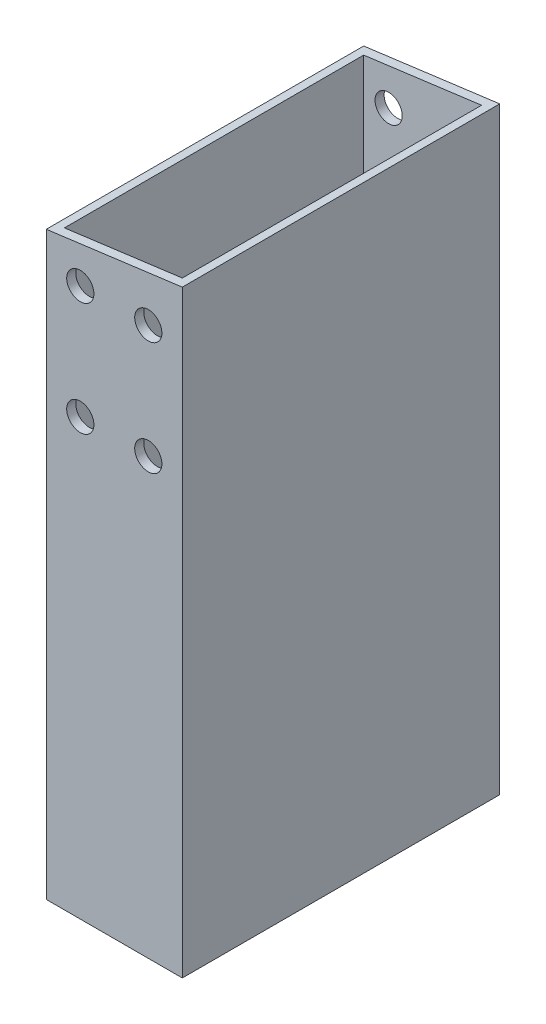
ISO-10303-21;
HEADER;
FILE_DESCRIPTION(('STEP AP214'),'2;1');
FILE_NAME('part.step','',(''),(''),'','','');
FILE_SCHEMA(('AUTOMOTIVE_DESIGN { 1 0 10303 214 1 1 1 1 }'));
ENDSEC;
DATA;
#1=APPLICATION_CONTEXT('core data for automotive mechanical design processes');
#2=APPLICATION_PROTOCOL_DEFINITION('international standard','automotive_design',2000,#1);
#3=PRODUCT_CONTEXT('',#1,'mechanical');
#4=PRODUCT('Part','Part','',(#3));
#5=PRODUCT_RELATED_PRODUCT_CATEGORY('part','',(#4));
#6=PRODUCT_DEFINITION_FORMATION('','',#4);
#7=PRODUCT_DEFINITION_CONTEXT('part definition',#1,'design');
#8=PRODUCT_DEFINITION('design','',#6,#7);
#9=PRODUCT_DEFINITION_SHAPE('','',#8);
#10=(LENGTH_UNIT() NAMED_UNIT(*) SI_UNIT(.MILLI.,.METRE.));
#11=(NAMED_UNIT(*) PLANE_ANGLE_UNIT() SI_UNIT($,.RADIAN.));
#12=(NAMED_UNIT(*) SI_UNIT($,.STERADIAN.) SOLID_ANGLE_UNIT());
#13=UNCERTAINTY_MEASURE_WITH_UNIT(LENGTH_MEASURE(1.E-05),#10,'distance_accuracy_value','');
#14=(GEOMETRIC_REPRESENTATION_CONTEXT(3) GLOBAL_UNCERTAINTY_ASSIGNED_CONTEXT((#13)) GLOBAL_UNIT_ASSIGNED_CONTEXT((#10,
#11,#12)) REPRESENTATION_CONTEXT('',''));
#15=CARTESIAN_POINT('',(0.,0.,0.));
#16=DIRECTION('',(0.,0.,1.));
#17=DIRECTION('',(1.,0.,0.));
#18=AXIS2_PLACEMENT_3D('',#15,#16,#17);
#19=CARTESIAN_POINT('',(0.,0.,70.));
#20=DIRECTION('',(0.,0.,1.));
#21=DIRECTION('',(1.,0.,0.));
#22=AXIS2_PLACEMENT_3D('',#19,#20,#21);
#23=PLANE('',#22);
#24=CARTESIAN_POINT('',(-7.49999999995055,338.968787119595,70.));
#25=DIRECTION('',(0.,0.,1.));
#26=DIRECTION('',(1.,0.,0.));
#27=AXIS2_PLACEMENT_3D('',#24,#25,#26);
#28=CIRCLE('',#27,3.);
#29=CARTESIAN_POINT('',(-4.49999999995055,338.968787119595,70.));
#30=VERTEX_POINT('',#29);
#31=EDGE_CURVE('E425',#30,#30,#28,.T.);
#32=ORIENTED_EDGE('',*,*,#31,.F.);
#33=EDGE_LOOP('',(#32));
#34=FACE_BOUND('',#33,.T.);
#35=CARTESIAN_POINT('',(7.50000000004941,338.968787119595,70.));
#36=DIRECTION('',(0.,0.,1.));
#37=DIRECTION('',(1.,0.,0.));
#38=AXIS2_PLACEMENT_3D('',#35,#36,#37);
#39=CIRCLE('',#38,3.);
#40=CARTESIAN_POINT('',(10.5000000000494,338.968787119595,70.));
#41=VERTEX_POINT('',#40);
#42=EDGE_CURVE('E428',#41,#41,#39,.T.);
#43=ORIENTED_EDGE('',*,*,#42,.F.);
#44=EDGE_LOOP('',(#43));
#45=FACE_BOUND('',#44,.T.);
#46=CARTESIAN_POINT('',(7.50000000004938,363.968787119595,70.));
#47=DIRECTION('',(0.,0.,1.));
#48=DIRECTION('',(1.,0.,0.));
#49=AXIS2_PLACEMENT_3D('',#46,#47,#48);
#50=CIRCLE('',#49,3.);
#51=CARTESIAN_POINT('',(10.5000000000494,363.968787119595,70.));
#52=VERTEX_POINT('',#51);
#53=EDGE_CURVE('E424',#52,#52,#50,.T.);
#54=ORIENTED_EDGE('',*,*,#53,.F.);
#55=EDGE_LOOP('',(#54));
#56=FACE_BOUND('',#55,.T.);
#57=CARTESIAN_POINT('',(-7.4999999999506,363.968787119595,70.));
#58=DIRECTION('',(0.,0.,1.));
#59=DIRECTION('',(1.,0.,0.));
#60=AXIS2_PLACEMENT_3D('',#57,#58,#59);
#61=CIRCLE('',#60,3.);
#62=CARTESIAN_POINT('',(-4.4999999999506,363.968787119595,70.));
#63=VERTEX_POINT('',#62);
#64=EDGE_CURVE('E141',#63,#63,#61,.T.);
#65=ORIENTED_EDGE('',*,*,#64,.F.);
#66=EDGE_LOOP('',(#65));
#67=FACE_BOUND('',#66,.T.);
#68=DIRECTION('',(1.,0.,0.));
#69=VECTOR('',#68,1.);
#70=CARTESIAN_POINT('',(15.,243.050425072378,70.));
#71=LINE('',#70,#69);
#72=CARTESIAN_POINT('',(-15.,243.050425072378,70.));
#73=VERTEX_POINT('',#72);
#74=CARTESIAN_POINT('',(15.,243.050425072378,70.));
#75=VERTEX_POINT('',#74);
#76=EDGE_CURVE('E104',#73,#75,#71,.T.);
#77=ORIENTED_EDGE('',*,*,#76,.T.);
#78=DIRECTION('',(0.,1.,0.));
#79=VECTOR('',#78,1.);
#80=CARTESIAN_POINT('',(15.,-375.,70.));
#81=LINE('',#80,#79);
#82=CARTESIAN_POINT('',(15.,375.,70.));
#83=VERTEX_POINT('',#82);
#84=EDGE_CURVE('E124',#75,#83,#81,.T.);
#85=ORIENTED_EDGE('',*,*,#84,.T.);
#86=DIRECTION('',(-0.99144486137381,-0.130526192220055,0.));
#87=VECTOR('',#86,1.);
#88=CARTESIAN_POINT('',(15.,375.,70.));
#89=LINE('',#88,#87);
#90=CARTESIAN_POINT('',(-15.,371.050425072378,70.));
#91=VERTEX_POINT('',#90);
#92=EDGE_CURVE('E123',#83,#91,#89,.T.);
#93=ORIENTED_EDGE('',*,*,#92,.T.);
#94=DIRECTION('',(0.,-1.,0.));
#95=VECTOR('',#94,1.);
#96=CARTESIAN_POINT('',(-15.,-375.,70.));
#97=LINE('',#96,#95);
#98=EDGE_CURVE('E117',#91,#73,#97,.T.);
#99=ORIENTED_EDGE('',*,*,#98,.T.);
#100=EDGE_LOOP('',(#77,#85,#93,#99));
#101=FACE_BOUND('',#100,.T.);
#102=ADVANCED_FACE('F39',(#34,#45,#56,#67,#101),#23,.T.);
#103=CARTESIAN_POINT('',(0.,0.,0.));
#104=DIRECTION('',(0.,0.,1.));
#105=DIRECTION('',(1.,0.,0.));
#106=AXIS2_PLACEMENT_3D('',#103,#104,#105);
#107=PLANE('',#106);
#108=CARTESIAN_POINT('',(-7.49999999995055,338.968787119595,0.));
#109=DIRECTION('',(0.,0.,1.));
#110=DIRECTION('',(1.,0.,0.));
#111=AXIS2_PLACEMENT_3D('',#108,#109,#110);
#112=CIRCLE('',#111,3.);
#113=CARTESIAN_POINT('',(-4.49999999995055,338.968787119595,0.));
#114=VERTEX_POINT('',#113);
#115=EDGE_CURVE('E168',#114,#114,#112,.T.);
#116=ORIENTED_EDGE('',*,*,#115,.T.);
#117=EDGE_LOOP('',(#116));
#118=FACE_BOUND('',#117,.T.);
#119=CARTESIAN_POINT('',(7.50000000004941,338.968787119595,0.));
#120=DIRECTION('',(0.,0.,1.));
#121=DIRECTION('',(1.,0.,0.));
#122=AXIS2_PLACEMENT_3D('',#119,#120,#121);
#123=CIRCLE('',#122,3.);
#124=CARTESIAN_POINT('',(10.5000000000494,338.968787119595,0.));
#125=VERTEX_POINT('',#124);
#126=EDGE_CURVE('E153',#125,#125,#123,.T.);
#127=ORIENTED_EDGE('',*,*,#126,.T.);
#128=EDGE_LOOP('',(#127));
#129=FACE_BOUND('',#128,.T.);
#130=CARTESIAN_POINT('',(7.50000000004938,363.968787119595,0.));
#131=DIRECTION('',(0.,0.,1.));
#132=DIRECTION('',(1.,0.,0.));
#133=AXIS2_PLACEMENT_3D('',#130,#131,#132);
#134=CIRCLE('',#133,3.);
#135=CARTESIAN_POINT('',(10.5000000000494,363.968787119595,0.));
#136=VERTEX_POINT('',#135);
#137=EDGE_CURVE('E149',#136,#136,#134,.T.);
#138=ORIENTED_EDGE('',*,*,#137,.T.);
#139=EDGE_LOOP('',(#138));
#140=FACE_BOUND('',#139,.T.);
#141=CARTESIAN_POINT('',(-7.4999999999506,363.968787119595,0.));
#142=DIRECTION('',(0.,0.,1.));
#143=DIRECTION('',(1.,0.,0.));
#144=AXIS2_PLACEMENT_3D('',#141,#142,#143);
#145=CIRCLE('',#144,3.);
#146=CARTESIAN_POINT('',(-4.4999999999506,363.968787119595,0.));
#147=VERTEX_POINT('',#146);
#148=EDGE_CURVE('E145',#147,#147,#145,.T.);
#149=ORIENTED_EDGE('',*,*,#148,.T.);
#150=EDGE_LOOP('',(#149));
#151=FACE_BOUND('',#150,.T.);
#152=DIRECTION('',(0.,1.,0.));
#153=VECTOR('',#152,1.);
#154=CARTESIAN_POINT('',(15.,-375.,0.));
#155=LINE('',#154,#153);
#156=CARTESIAN_POINT('',(15.,243.050425072378,0.));
#157=VERTEX_POINT('',#156);
#158=CARTESIAN_POINT('',(15.,375.,0.));
#159=VERTEX_POINT('',#158);
#160=EDGE_CURVE('E125',#157,#159,#155,.T.);
#161=ORIENTED_EDGE('',*,*,#160,.F.);
#162=DIRECTION('',(1.,0.,0.));
#163=VECTOR('',#162,1.);
#164=CARTESIAN_POINT('',(15.,243.050425072378,0.));
#165=LINE('',#164,#163);
#166=CARTESIAN_POINT('',(-15.,243.050425072378,0.));
#167=VERTEX_POINT('',#166);
#168=EDGE_CURVE('E64',#167,#157,#165,.T.);
#169=ORIENTED_EDGE('',*,*,#168,.F.);
#170=DIRECTION('',(0.,-1.,0.));
#171=VECTOR('',#170,1.);
#172=CARTESIAN_POINT('',(-15.,-375.,0.));
#173=LINE('',#172,#171);
#174=CARTESIAN_POINT('',(-15.,371.050425072378,0.));
#175=VERTEX_POINT('',#174);
#176=EDGE_CURVE('E119',#175,#167,#173,.T.);
#177=ORIENTED_EDGE('',*,*,#176,.F.);
#178=DIRECTION('',(-0.99144486137381,-0.130526192220055,0.));
#179=VECTOR('',#178,1.);
#180=CARTESIAN_POINT('',(15.,375.,0.));
#181=LINE('',#180,#179);
#182=EDGE_CURVE('E184',#159,#175,#181,.T.);
#183=ORIENTED_EDGE('',*,*,#182,.F.);
#184=EDGE_LOOP('',(#161,#169,#177,#183));
#185=FACE_BOUND('',#184,.T.);
#186=ADVANCED_FACE('F230',(#118,#129,#140,#151,#185),#107,.F.);
#187=CARTESIAN_POINT('',(-15.,-375.,70.));
#188=DIRECTION('',(1.,0.,0.));
#189=DIRECTION('',(0.,1.,0.));
#190=AXIS2_PLACEMENT_3D('',#187,#188,#189);
#191=PLANE('',#190);
#192=ORIENTED_EDGE('',*,*,#176,.T.);
#193=DIRECTION('',(0.,0.,-1.));
#194=VECTOR('',#193,1.);
#195=CARTESIAN_POINT('',(-15.,243.050425072378,70.));
#196=LINE('',#195,#194);
#197=EDGE_CURVE('E107',#73,#167,#196,.T.);
#198=ORIENTED_EDGE('',*,*,#197,.F.);
#199=ORIENTED_EDGE('',*,*,#98,.F.);
#200=DIRECTION('',(0.,0.,1.));
#201=VECTOR('',#200,1.);
#202=CARTESIAN_POINT('',(-15.,371.050425072378,0.));
#203=LINE('',#202,#201);
#204=EDGE_CURVE('E182',#175,#91,#203,.T.);
#205=ORIENTED_EDGE('',*,*,#204,.F.);
#206=EDGE_LOOP('',(#192,#198,#199,#205));
#207=FACE_BOUND('',#206,.T.);
#208=ADVANCED_FACE('F41',(#207),#191,.F.);
#209=CARTESIAN_POINT('',(-13.,375.,2.));
#210=DIRECTION('',(0.,0.,-1.));
#211=DIRECTION('',(-1.,0.,0.));
#212=AXIS2_PLACEMENT_3D('',#209,#210,#211);
#213=PLANE('',#212);
#214=CARTESIAN_POINT('',(-7.49999999995055,338.968787119595,2.));
#215=DIRECTION('',(0.,0.,-1.));
#216=DIRECTION('',(-1.,0.,0.));
#217=AXIS2_PLACEMENT_3D('',#214,#215,#216);
#218=CIRCLE('',#217,3.);
#219=CARTESIAN_POINT('',(-10.4999999999505,338.968787119595,2.));
#220=VERTEX_POINT('',#219);
#221=EDGE_CURVE('E165',#220,#220,#218,.T.);
#222=ORIENTED_EDGE('',*,*,#221,.T.);
#223=EDGE_LOOP('',(#222));
#224=FACE_BOUND('',#223,.T.);
#225=CARTESIAN_POINT('',(7.50000000004941,338.968787119595,2.));
#226=DIRECTION('',(0.,0.,-1.));
#227=DIRECTION('',(-1.,0.,0.));
#228=AXIS2_PLACEMENT_3D('',#225,#226,#227);
#229=CIRCLE('',#228,3.);
#230=CARTESIAN_POINT('',(4.50000000004941,338.968787119595,2.));
#231=VERTEX_POINT('',#230);
#232=EDGE_CURVE('E148',#231,#231,#229,.T.);
#233=ORIENTED_EDGE('',*,*,#232,.T.);
#234=EDGE_LOOP('',(#233));
#235=FACE_BOUND('',#234,.T.);
#236=CARTESIAN_POINT('',(7.50000000004938,363.968787119595,2.));
#237=DIRECTION('',(0.,0.,-1.));
#238=DIRECTION('',(-1.,0.,0.));
#239=AXIS2_PLACEMENT_3D('',#236,#237,#238);
#240=CIRCLE('',#239,3.);
#241=CARTESIAN_POINT('',(4.50000000004938,363.968787119595,2.));
#242=VERTEX_POINT('',#241);
#243=EDGE_CURVE('E144',#242,#242,#240,.T.);
#244=ORIENTED_EDGE('',*,*,#243,.T.);
#245=EDGE_LOOP('',(#244));
#246=FACE_BOUND('',#245,.T.);
#247=CARTESIAN_POINT('',(-7.4999999999506,363.968787119595,2.));
#248=DIRECTION('',(0.,0.,-1.));
#249=DIRECTION('',(-1.,0.,0.));
#250=AXIS2_PLACEMENT_3D('',#247,#248,#249);
#251=CIRCLE('',#250,3.);
#252=CARTESIAN_POINT('',(-10.4999999999506,363.968787119595,2.));
#253=VERTEX_POINT('',#252);
#254=EDGE_CURVE('E140',#253,#253,#251,.T.);
#255=ORIENTED_EDGE('',*,*,#254,.T.);
#256=EDGE_LOOP('',(#255));
#257=FACE_BOUND('',#256,.T.);
#258=DIRECTION('',(0.,-1.,0.));
#259=VECTOR('',#258,1.);
#260=CARTESIAN_POINT('',(-13.,375.,2.));
#261=LINE('',#260,#259);
#262=CARTESIAN_POINT('',(-13.,371.313730067553,2.));
#263=VERTEX_POINT('',#262);
#264=CARTESIAN_POINT('',(-13.,243.050425072378,2.));
#265=VERTEX_POINT('',#264);
#266=EDGE_CURVE('E133',#263,#265,#261,.T.);
#267=ORIENTED_EDGE('',*,*,#266,.T.);
#268=DIRECTION('',(1.,0.,0.));
#269=VECTOR('',#268,1.);
#270=CARTESIAN_POINT('',(-13.,243.050425072378,2.));
#271=LINE('',#270,#269);
#272=CARTESIAN_POINT('',(13.,243.050425072378,2.));
#273=VERTEX_POINT('',#272);
#274=EDGE_CURVE('E179',#265,#273,#271,.T.);
#275=ORIENTED_EDGE('',*,*,#274,.T.);
#276=DIRECTION('',(0.,-1.,0.));
#277=VECTOR('',#276,1.);
#278=CARTESIAN_POINT('',(13.,375.,2.));
#279=LINE('',#278,#277);
#280=CARTESIAN_POINT('',(13.,374.736695004825,2.));
#281=VERTEX_POINT('',#280);
#282=EDGE_CURVE('E130',#281,#273,#279,.T.);
#283=ORIENTED_EDGE('',*,*,#282,.F.);
#284=DIRECTION('',(0.99144486137381,0.130526192220055,0.));
#285=VECTOR('',#284,1.);
#286=CARTESIAN_POINT('',(-12.5229615680469,371.376533368565,2.));
#287=LINE('',#286,#285);
#288=EDGE_CURVE('E192',#263,#281,#287,.T.);
#289=ORIENTED_EDGE('',*,*,#288,.F.);
#290=EDGE_LOOP('',(#267,#275,#283,#289));
#291=FACE_BOUND('',#290,.T.);
#292=ADVANCED_FACE('F208',(#224,#235,#246,#257,#291),#213,.F.);
#293=CARTESIAN_POINT('',(-13.,375.,68.));
#294=DIRECTION('',(-1.,0.,0.));
#295=DIRECTION('',(0.,0.,1.));
#296=AXIS2_PLACEMENT_3D('',#293,#294,#295);
#297=PLANE('',#296);
#298=DIRECTION('',(0.,-1.,0.));
#299=VECTOR('',#298,1.);
#300=CARTESIAN_POINT('',(-13.,375.,68.));
#301=LINE('',#300,#299);
#302=CARTESIAN_POINT('',(-13.,371.313730067553,68.));
#303=VERTEX_POINT('',#302);
#304=CARTESIAN_POINT('',(-13.,243.050425072378,68.));
#305=VERTEX_POINT('',#304);
#306=EDGE_CURVE('E196',#303,#305,#301,.T.);
#307=ORIENTED_EDGE('',*,*,#306,.T.);
#308=DIRECTION('',(0.,0.,-1.));
#309=VECTOR('',#308,1.);
#310=CARTESIAN_POINT('',(-13.,243.050425072378,68.));
#311=LINE('',#310,#309);
#312=EDGE_CURVE('E176',#305,#265,#311,.T.);
#313=ORIENTED_EDGE('',*,*,#312,.T.);
#314=ORIENTED_EDGE('',*,*,#266,.F.);
#315=DIRECTION('',(0.,0.,-1.));
#316=VECTOR('',#315,1.);
#317=CARTESIAN_POINT('',(-13.,371.313730067553,68.));
#318=LINE('',#317,#316);
#319=EDGE_CURVE('E190',#303,#263,#318,.T.);
#320=ORIENTED_EDGE('',*,*,#319,.F.);
#321=EDGE_LOOP('',(#307,#313,#314,#320));
#322=FACE_BOUND('',#321,.T.);
#323=ADVANCED_FACE('F211',(#322),#297,.F.);
#324=CARTESIAN_POINT('',(-13.,375.,68.));
#325=DIRECTION('',(0.,0.,-1.));
#326=DIRECTION('',(-1.,0.,0.));
#327=AXIS2_PLACEMENT_3D('',#324,#325,#326);
#328=PLANE('',#327);
#329=CARTESIAN_POINT('',(-7.49999999995055,338.968787119595,68.));
#330=DIRECTION('',(0.,0.,-1.));
#331=DIRECTION('',(-1.,0.,0.));
#332=AXIS2_PLACEMENT_3D('',#329,#330,#331);
#333=CIRCLE('',#332,3.);
#334=CARTESIAN_POINT('',(-10.4999999999505,338.968787119595,68.));
#335=VERTEX_POINT('',#334);
#336=EDGE_CURVE('E43',#335,#335,#333,.T.);
#337=ORIENTED_EDGE('',*,*,#336,.F.);
#338=EDGE_LOOP('',(#337));
#339=FACE_BOUND('',#338,.T.);
#340=CARTESIAN_POINT('',(7.50000000004941,338.968787119595,68.));
#341=DIRECTION('',(0.,0.,-1.));
#342=DIRECTION('',(-1.,0.,0.));
#343=AXIS2_PLACEMENT_3D('',#340,#341,#342);
#344=CIRCLE('',#343,3.);
#345=CARTESIAN_POINT('',(4.50000000004941,338.968787119595,68.));
#346=VERTEX_POINT('',#345);
#347=EDGE_CURVE('E146',#346,#346,#344,.T.);
#348=ORIENTED_EDGE('',*,*,#347,.F.);
#349=EDGE_LOOP('',(#348));
#350=FACE_BOUND('',#349,.T.);
#351=CARTESIAN_POINT('',(7.50000000004938,363.968787119595,68.));
#352=DIRECTION('',(0.,0.,-1.));
#353=DIRECTION('',(-1.,0.,0.));
#354=AXIS2_PLACEMENT_3D('',#351,#352,#353);
#355=CIRCLE('',#354,3.);
#356=CARTESIAN_POINT('',(4.50000000004938,363.968787119595,68.));
#357=VERTEX_POINT('',#356);
#358=EDGE_CURVE('E142',#357,#357,#355,.T.);
#359=ORIENTED_EDGE('',*,*,#358,.F.);
#360=EDGE_LOOP('',(#359));
#361=FACE_BOUND('',#360,.T.);
#362=CARTESIAN_POINT('',(-7.4999999999506,363.968787119595,68.));
#363=DIRECTION('',(0.,0.,-1.));
#364=DIRECTION('',(-1.,0.,0.));
#365=AXIS2_PLACEMENT_3D('',#362,#363,#364);
#366=CIRCLE('',#365,3.);
#367=CARTESIAN_POINT('',(-10.4999999999506,363.968787119595,68.));
#368=VERTEX_POINT('',#367);
#369=EDGE_CURVE('E137',#368,#368,#366,.T.);
#370=ORIENTED_EDGE('',*,*,#369,.F.);
#371=EDGE_LOOP('',(#370));
#372=FACE_BOUND('',#371,.T.);
#373=DIRECTION('',(1.,0.,0.));
#374=VECTOR('',#373,1.);
#375=CARTESIAN_POINT('',(-13.,243.050425072378,68.));
#376=LINE('',#375,#374);
#377=CARTESIAN_POINT('',(13.,243.050425072378,68.));
#378=VERTEX_POINT('',#377);
#379=EDGE_CURVE('E56',#305,#378,#376,.T.);
#380=ORIENTED_EDGE('',*,*,#379,.F.);
#381=ORIENTED_EDGE('',*,*,#306,.F.);
#382=DIRECTION('',(0.99144486137381,0.130526192220055,0.));
#383=VECTOR('',#382,1.);
#384=CARTESIAN_POINT('',(-12.5229615680469,371.376533368565,68.));
#385=LINE('',#384,#383);
#386=CARTESIAN_POINT('',(13.,374.736695004825,68.));
#387=VERTEX_POINT('',#386);
#388=EDGE_CURVE('E186',#303,#387,#385,.T.);
#389=ORIENTED_EDGE('',*,*,#388,.T.);
#390=DIRECTION('',(0.,-1.,0.));
#391=VECTOR('',#390,1.);
#392=CARTESIAN_POINT('',(13.,375.,68.));
#393=LINE('',#392,#391);
#394=EDGE_CURVE('E198',#387,#378,#393,.T.);
#395=ORIENTED_EDGE('',*,*,#394,.T.);
#396=EDGE_LOOP('',(#380,#381,#389,#395));
#397=FACE_BOUND('',#396,.T.);
#398=ADVANCED_FACE('F214',(#339,#350,#361,#372,#397),#328,.T.);
#399=CARTESIAN_POINT('',(13.,375.,68.));
#400=DIRECTION('',(-1.,0.,0.));
#401=DIRECTION('',(0.,0.,1.));
#402=AXIS2_PLACEMENT_3D('',#399,#400,#401);
#403=PLANE('',#402);
#404=DIRECTION('',(0.,0.,-1.));
#405=VECTOR('',#404,1.);
#406=CARTESIAN_POINT('',(13.,243.050425072378,68.));
#407=LINE('',#406,#405);
#408=EDGE_CURVE('E172',#378,#273,#407,.T.);
#409=ORIENTED_EDGE('',*,*,#408,.F.);
#410=ORIENTED_EDGE('',*,*,#394,.F.);
#411=DIRECTION('',(0.,0.,-1.));
#412=VECTOR('',#411,1.);
#413=CARTESIAN_POINT('',(13.,374.736695004825,68.));
#414=LINE('',#413,#412);
#415=EDGE_CURVE('E11',#387,#281,#414,.T.);
#416=ORIENTED_EDGE('',*,*,#415,.T.);
#417=ORIENTED_EDGE('',*,*,#282,.T.);
#418=EDGE_LOOP('',(#409,#410,#416,#417));
#419=FACE_BOUND('',#418,.T.);
#420=ADVANCED_FACE('F205',(#419),#403,.T.);
#421=CARTESIAN_POINT('',(15.,-375.,70.));
#422=DIRECTION('',(-1.,0.,0.));
#423=DIRECTION('',(0.,0.,1.));
#424=AXIS2_PLACEMENT_3D('',#421,#422,#423);
#425=PLANE('',#424);
#426=ORIENTED_EDGE('',*,*,#84,.F.);
#427=DIRECTION('',(0.,0.,-1.));
#428=VECTOR('',#427,1.);
#429=CARTESIAN_POINT('',(15.,243.050425072378,70.));
#430=LINE('',#429,#428);
#431=EDGE_CURVE('E108',#75,#157,#430,.T.);
#432=ORIENTED_EDGE('',*,*,#431,.T.);
#433=ORIENTED_EDGE('',*,*,#160,.T.);
#434=DIRECTION('',(0.,0.,-1.));
#435=VECTOR('',#434,1.);
#436=CARTESIAN_POINT('',(15.,375.,70.));
#437=LINE('',#436,#435);
#438=EDGE_CURVE('E48',#83,#159,#437,.T.);
#439=ORIENTED_EDGE('',*,*,#438,.F.);
#440=EDGE_LOOP('',(#426,#432,#433,#439));
#441=FACE_BOUND('',#440,.T.);
#442=ADVANCED_FACE('F218',(#441),#425,.F.);
#443=CARTESIAN_POINT('',(15.,375.,0.));
#444=DIRECTION('',(-0.130526192220055,0.99144486137381,0.));
#445=DIRECTION('',(-0.99144486137381,-0.130526192220055,0.));
#446=AXIS2_PLACEMENT_3D('',#443,#444,#445);
#447=PLANE('',#446);
#448=ORIENTED_EDGE('',*,*,#92,.F.);
#449=ORIENTED_EDGE('',*,*,#438,.T.);
#450=ORIENTED_EDGE('',*,*,#182,.T.);
#451=ORIENTED_EDGE('',*,*,#204,.T.);
#452=EDGE_LOOP('',(#448,#449,#450,#451));
#453=FACE_BOUND('',#452,.T.);
#454=ORIENTED_EDGE('',*,*,#288,.T.);
#455=ORIENTED_EDGE('',*,*,#415,.F.);
#456=ORIENTED_EDGE('',*,*,#388,.F.);
#457=ORIENTED_EDGE('',*,*,#319,.T.);
#458=EDGE_LOOP('',(#454,#455,#456,#457));
#459=FACE_BOUND('',#458,.T.);
#460=ADVANCED_FACE('F216',(#453,#459),#447,.T.);
#461=CARTESIAN_POINT('',(15.,243.050425072378,70.));
#462=DIRECTION('',(0.,1.,0.));
#463=DIRECTION('',(0.,0.,1.));
#464=AXIS2_PLACEMENT_3D('',#461,#462,#463);
#465=PLANE('',#464);
#466=ORIENTED_EDGE('',*,*,#168,.T.);
#467=ORIENTED_EDGE('',*,*,#431,.F.);
#468=ORIENTED_EDGE('',*,*,#76,.F.);
#469=ORIENTED_EDGE('',*,*,#197,.T.);
#470=EDGE_LOOP('',(#466,#467,#468,#469));
#471=FACE_BOUND('',#470,.T.);
#472=ORIENTED_EDGE('',*,*,#312,.F.);
#473=ORIENTED_EDGE('',*,*,#379,.T.);
#474=ORIENTED_EDGE('',*,*,#408,.T.);
#475=ORIENTED_EDGE('',*,*,#274,.F.);
#476=EDGE_LOOP('',(#472,#473,#474,#475));
#477=FACE_BOUND('',#476,.T.);
#478=ADVANCED_FACE('F106',(#471,#477),#465,.F.);
#479=CARTESIAN_POINT('',(-7.4999999999506,363.968787119595,-21.));
#480=DIRECTION('',(0.,0.,1.));
#481=DIRECTION('',(1.,0.,0.));
#482=AXIS2_PLACEMENT_3D('',#479,#480,#481);
#483=CYLINDRICAL_SURFACE('',#482,3.);
#484=ORIENTED_EDGE('',*,*,#369,.T.);
#485=EDGE_LOOP('',(#484));
#486=FACE_BOUND('',#485,.T.);
#487=ORIENTED_EDGE('',*,*,#64,.T.);
#488=EDGE_LOOP('',(#487));
#489=FACE_BOUND('',#488,.T.);
#490=ADVANCED_FACE('F225',(#486,#489),#483,.F.);
#491=CARTESIAN_POINT('',(7.50000000004938,363.968787119595,-21.));
#492=DIRECTION('',(0.,0.,1.));
#493=DIRECTION('',(1.,0.,0.));
#494=AXIS2_PLACEMENT_3D('',#491,#492,#493);
#495=CYLINDRICAL_SURFACE('',#494,3.);
#496=ORIENTED_EDGE('',*,*,#358,.T.);
#497=EDGE_LOOP('',(#496));
#498=FACE_BOUND('',#497,.T.);
#499=ORIENTED_EDGE('',*,*,#53,.T.);
#500=EDGE_LOOP('',(#499));
#501=FACE_BOUND('',#500,.T.);
#502=ADVANCED_FACE('F322',(#498,#501),#495,.F.);
#503=CARTESIAN_POINT('',(7.50000000004941,338.968787119595,-21.));
#504=DIRECTION('',(0.,0.,1.));
#505=DIRECTION('',(1.,0.,0.));
#506=AXIS2_PLACEMENT_3D('',#503,#504,#505);
#507=CYLINDRICAL_SURFACE('',#506,3.);
#508=ORIENTED_EDGE('',*,*,#347,.T.);
#509=EDGE_LOOP('',(#508));
#510=FACE_BOUND('',#509,.T.);
#511=ORIENTED_EDGE('',*,*,#42,.T.);
#512=EDGE_LOOP('',(#511));
#513=FACE_BOUND('',#512,.T.);
#514=ADVANCED_FACE('F332',(#510,#513),#507,.F.);
#515=CARTESIAN_POINT('',(-7.49999999995055,338.968787119595,-21.));
#516=DIRECTION('',(0.,0.,1.));
#517=DIRECTION('',(1.,0.,0.));
#518=AXIS2_PLACEMENT_3D('',#515,#516,#517);
#519=CYLINDRICAL_SURFACE('',#518,3.);
#520=ORIENTED_EDGE('',*,*,#336,.T.);
#521=EDGE_LOOP('',(#520));
#522=FACE_BOUND('',#521,.T.);
#523=ORIENTED_EDGE('',*,*,#31,.T.);
#524=EDGE_LOOP('',(#523));
#525=FACE_BOUND('',#524,.T.);
#526=ADVANCED_FACE('F343',(#522,#525),#519,.F.);
#527=ORIENTED_EDGE('',*,*,#254,.F.);
#528=EDGE_LOOP('',(#527));
#529=FACE_BOUND('',#528,.T.);
#530=ORIENTED_EDGE('',*,*,#148,.F.);
#531=EDGE_LOOP('',(#530));
#532=FACE_BOUND('',#531,.T.);
#533=ADVANCED_FACE('F325',(#529,#532),#483,.F.);
#534=ORIENTED_EDGE('',*,*,#243,.F.);
#535=EDGE_LOOP('',(#534));
#536=FACE_BOUND('',#535,.T.);
#537=ORIENTED_EDGE('',*,*,#137,.F.);
#538=EDGE_LOOP('',(#537));
#539=FACE_BOUND('',#538,.T.);
#540=ADVANCED_FACE('F335',(#536,#539),#495,.F.);
#541=ORIENTED_EDGE('',*,*,#232,.F.);
#542=EDGE_LOOP('',(#541));
#543=FACE_BOUND('',#542,.T.);
#544=ORIENTED_EDGE('',*,*,#126,.F.);
#545=EDGE_LOOP('',(#544));
#546=FACE_BOUND('',#545,.T.);
#547=ADVANCED_FACE('F345',(#543,#546),#507,.F.);
#548=ORIENTED_EDGE('',*,*,#221,.F.);
#549=EDGE_LOOP('',(#548));
#550=FACE_BOUND('',#549,.T.);
#551=ORIENTED_EDGE('',*,*,#115,.F.);
#552=EDGE_LOOP('',(#551));
#553=FACE_BOUND('',#552,.T.);
#554=ADVANCED_FACE('F355',(#550,#553),#519,.F.);
#555=CLOSED_SHELL('',(#102,#186,#208,#292,#323,#398,#420,#442,#460,#478,#490,#502,#514,#526,
#533,#540,#547,#554));
#556=MANIFOLD_SOLID_BREP('B2',#555);
#557=ADVANCED_BREP_SHAPE_REPRESENTATION('',(#18,#556),#14);
#558=SHAPE_DEFINITION_REPRESENTATION(#9,#557);
ENDSEC;
END-ISO-10303-21;
